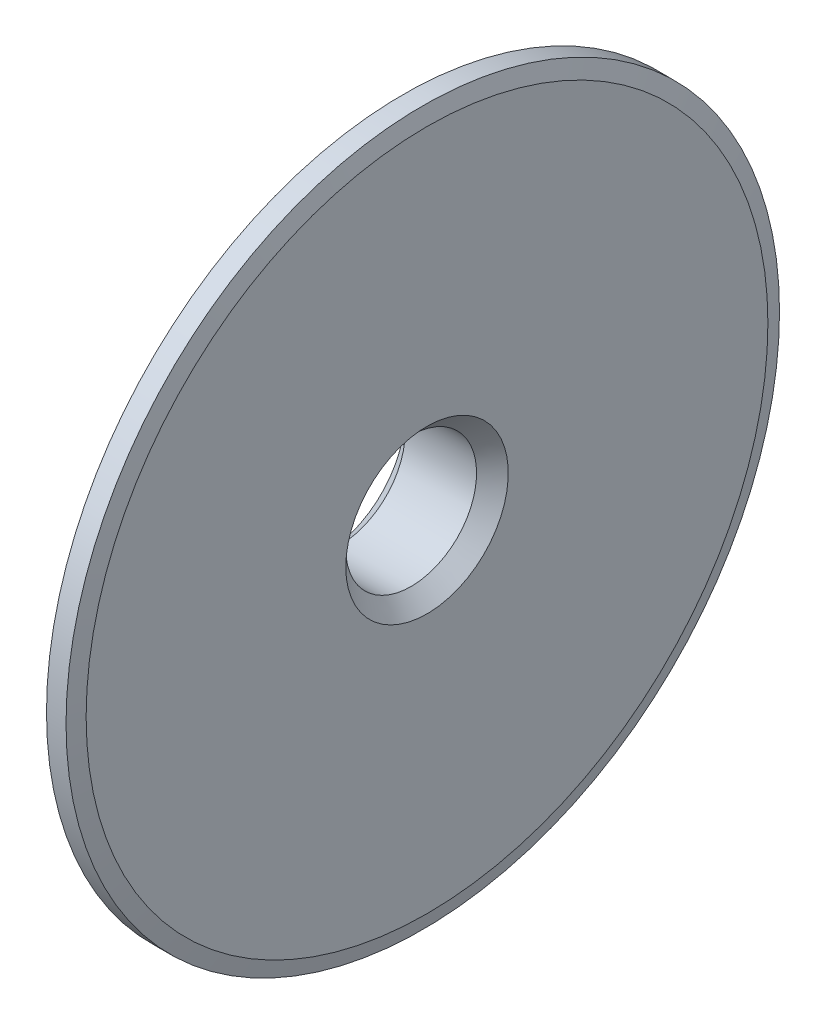
ISO-10303-21;
HEADER;
FILE_DESCRIPTION(('STEP AP214'),'2;1');
FILE_NAME('part.step','',(''),(''),'','','');
FILE_SCHEMA(('AUTOMOTIVE_DESIGN { 1 0 10303 214 1 1 1 1 }'));
ENDSEC;
DATA;
#1=APPLICATION_CONTEXT('core data for automotive mechanical design processes');
#2=APPLICATION_PROTOCOL_DEFINITION('international standard','automotive_design',2000,#1);
#3=PRODUCT_CONTEXT('',#1,'mechanical');
#4=PRODUCT('Part','Part','',(#3));
#5=PRODUCT_RELATED_PRODUCT_CATEGORY('part','',(#4));
#6=PRODUCT_DEFINITION_FORMATION('','',#4);
#7=PRODUCT_DEFINITION_CONTEXT('part definition',#1,'design');
#8=PRODUCT_DEFINITION('design','',#6,#7);
#9=PRODUCT_DEFINITION_SHAPE('','',#8);
#10=(LENGTH_UNIT() NAMED_UNIT(*) SI_UNIT(.MILLI.,.METRE.));
#11=(NAMED_UNIT(*) PLANE_ANGLE_UNIT() SI_UNIT($,.RADIAN.));
#12=(NAMED_UNIT(*) SI_UNIT($,.STERADIAN.) SOLID_ANGLE_UNIT());
#13=UNCERTAINTY_MEASURE_WITH_UNIT(LENGTH_MEASURE(1.E-05),#10,'distance_accuracy_value','');
#14=(GEOMETRIC_REPRESENTATION_CONTEXT(3) GLOBAL_UNCERTAINTY_ASSIGNED_CONTEXT((#13)) GLOBAL_UNIT_ASSIGNED_CONTEXT((#10,
#11,#12)) REPRESENTATION_CONTEXT('',''));
#15=CARTESIAN_POINT('',(0.,0.,0.));
#16=DIRECTION('',(0.,0.,1.));
#17=DIRECTION('',(1.,0.,0.));
#18=AXIS2_PLACEMENT_3D('',#15,#16,#17);
#19=CARTESIAN_POINT('',(0.,12.5,0.));
#20=DIRECTION('',(1.,0.,0.));
#21=DIRECTION('',(0.,0.,-1.));
#22=AXIS2_PLACEMENT_3D('',#19,#20,#21);
#23=PLANE('',#22);
#24=CARTESIAN_POINT('',(0.,0.,0.));
#25=DIRECTION('',(1.,0.,0.));
#26=DIRECTION('',(0.,0.,-1.));
#27=AXIS2_PLACEMENT_3D('',#24,#25,#26);
#28=CIRCLE('',#27,12.);
#29=CARTESIAN_POINT('',(0.,0.,-12.));
#30=VERTEX_POINT('',#29);
#31=EDGE_CURVE('E80',#30,#30,#28,.F.);
#32=ORIENTED_EDGE('',*,*,#31,.T.);
#33=EDGE_LOOP('',(#32));
#34=FACE_BOUND('',#33,.T.);
#35=CARTESIAN_POINT('',(0.,0.,0.));
#36=DIRECTION('',(1.,0.,0.));
#37=DIRECTION('',(0.,0.,-1.));
#38=AXIS2_PLACEMENT_3D('',#35,#36,#37);
#39=CIRCLE('',#38,10.25);
#40=CARTESIAN_POINT('',(0.,0.,-10.25));
#41=VERTEX_POINT('',#40);
#42=EDGE_CURVE('E84',#41,#41,#39,.T.);
#43=ORIENTED_EDGE('',*,*,#42,.T.);
#44=EDGE_LOOP('',(#43));
#45=FACE_BOUND('',#44,.T.);
#46=ADVANCED_FACE('F51',(#34,#45),#23,.F.);
#47=CARTESIAN_POINT('',(0.,0.,0.));
#48=DIRECTION('',(-1.,0.,0.));
#49=DIRECTION('',(0.,0.,1.));
#50=AXIS2_PLACEMENT_3D('',#47,#48,#49);
#51=CYLINDRICAL_SURFACE('',#50,8.25);
#52=CARTESIAN_POINT('',(11.,0.,0.));
#53=DIRECTION('',(-1.,0.,0.));
#54=DIRECTION('',(0.,0.,1.));
#55=AXIS2_PLACEMENT_3D('',#52,#53,#54);
#56=CIRCLE('',#55,8.25);
#57=CARTESIAN_POINT('',(11.,0.,8.25));
#58=VERTEX_POINT('',#57);
#59=EDGE_CURVE('E88',#58,#58,#56,.F.);
#60=ORIENTED_EDGE('',*,*,#59,.T.);
#61=EDGE_LOOP('',(#60));
#62=FACE_BOUND('',#61,.T.);
#63=CARTESIAN_POINT('',(1.99999999999999,0.,0.));
#64=DIRECTION('',(1.,0.,0.));
#65=DIRECTION('',(0.,0.,-1.));
#66=AXIS2_PLACEMENT_3D('',#63,#64,#65);
#67=CIRCLE('',#66,8.25);
#68=CARTESIAN_POINT('',(1.99999999999999,0.,-8.25));
#69=VERTEX_POINT('',#68);
#70=EDGE_CURVE('E92',#69,#69,#67,.F.);
#71=ORIENTED_EDGE('',*,*,#70,.T.);
#72=EDGE_LOOP('',(#71));
#73=FACE_BOUND('',#72,.T.);
#74=ADVANCED_FACE('F145',(#62,#73),#51,.F.);
#75=CARTESIAN_POINT('',(13.,8.25,0.));
#76=DIRECTION('',(-1.,0.,0.));
#77=DIRECTION('',(0.,0.,1.));
#78=AXIS2_PLACEMENT_3D('',#75,#76,#77);
#79=PLANE('',#78);
#80=CARTESIAN_POINT('',(13.,0.,0.));
#81=DIRECTION('',(-1.,0.,0.));
#82=DIRECTION('',(0.,0.,1.));
#83=AXIS2_PLACEMENT_3D('',#80,#81,#82);
#84=CIRCLE('',#83,10.25);
#85=CARTESIAN_POINT('',(13.,0.,10.25));
#86=VERTEX_POINT('',#85);
#87=EDGE_CURVE('E96',#86,#86,#84,.T.);
#88=ORIENTED_EDGE('',*,*,#87,.T.);
#89=EDGE_LOOP('',(#88));
#90=FACE_BOUND('',#89,.T.);
#91=CARTESIAN_POINT('',(13.,0.,0.));
#92=DIRECTION('',(-1.,0.,0.));
#93=DIRECTION('',(0.,0.,1.));
#94=AXIS2_PLACEMENT_3D('',#91,#92,#93);
#95=CIRCLE('',#94,43.);
#96=CARTESIAN_POINT('',(13.,0.,43.));
#97=VERTEX_POINT('',#96);
#98=EDGE_CURVE('E100',#97,#97,#95,.T.);
#99=ORIENTED_EDGE('',*,*,#98,.F.);
#100=EDGE_LOOP('',(#99));
#101=FACE_BOUND('',#100,.T.);
#102=ADVANCED_FACE('F153',(#90,#101),#79,.F.);
#103=CARTESIAN_POINT('',(13.,0.,0.));
#104=DIRECTION('',(-1.,0.,0.));
#105=DIRECTION('',(0.,0.,1.));
#106=AXIS2_PLACEMENT_3D('',#103,#104,#105);
#107=CONICAL_SURFACE('',#106,43.,1.30899693899575);
#108=CARTESIAN_POINT('',(12.4641016151378,0.,0.));
#109=DIRECTION('',(-1.,0.,0.));
#110=DIRECTION('',(0.,0.,1.));
#111=AXIS2_PLACEMENT_3D('',#108,#109,#110);
#112=CIRCLE('',#111,45.);
#113=CARTESIAN_POINT('',(12.4641016151378,0.,45.));
#114=VERTEX_POINT('',#113);
#115=EDGE_CURVE('E104',#114,#114,#112,.T.);
#116=ORIENTED_EDGE('',*,*,#115,.F.);
#117=EDGE_LOOP('',(#116));
#118=FACE_BOUND('',#117,.T.);
#119=ORIENTED_EDGE('',*,*,#98,.T.);
#120=EDGE_LOOP('',(#119));
#121=FACE_BOUND('',#120,.T.);
#122=ADVANCED_FACE('F271',(#118,#121),#107,.T.);
#123=CARTESIAN_POINT('',(0.,0.,0.));
#124=DIRECTION('',(-1.,0.,0.));
#125=DIRECTION('',(0.,0.,1.));
#126=AXIS2_PLACEMENT_3D('',#123,#124,#125);
#127=CYLINDRICAL_SURFACE('',#126,45.);
#128=CARTESIAN_POINT('',(9.99999999999999,0.,0.));
#129=DIRECTION('',(-1.,0.,0.));
#130=DIRECTION('',(0.,0.,1.));
#131=AXIS2_PLACEMENT_3D('',#128,#129,#130);
#132=CIRCLE('',#131,45.);
#133=CARTESIAN_POINT('',(9.99999999999999,0.,45.));
#134=VERTEX_POINT('',#133);
#135=EDGE_CURVE('E108',#134,#134,#132,.T.);
#136=ORIENTED_EDGE('',*,*,#135,.F.);
#137=EDGE_LOOP('',(#136));
#138=FACE_BOUND('',#137,.T.);
#139=ORIENTED_EDGE('',*,*,#115,.T.);
#140=EDGE_LOOP('',(#139));
#141=FACE_BOUND('',#140,.T.);
#142=ADVANCED_FACE('F261',(#138,#141),#127,.T.);
#143=CARTESIAN_POINT('',(9.99999999999999,45.,0.));
#144=DIRECTION('',(1.,0.,0.));
#145=DIRECTION('',(0.,0.,-1.));
#146=AXIS2_PLACEMENT_3D('',#143,#144,#145);
#147=PLANE('',#146);
#148=CARTESIAN_POINT('',(9.99999999999999,0.,0.));
#149=DIRECTION('',(-1.,0.,0.));
#150=DIRECTION('',(0.,0.,1.));
#151=AXIS2_PLACEMENT_3D('',#148,#149,#150);
#152=CIRCLE('',#151,32.5);
#153=CARTESIAN_POINT('',(9.99999999999999,0.,32.5));
#154=VERTEX_POINT('',#153);
#155=EDGE_CURVE('E112',#154,#154,#152,.T.);
#156=ORIENTED_EDGE('',*,*,#155,.F.);
#157=EDGE_LOOP('',(#156));
#158=FACE_BOUND('',#157,.T.);
#159=ORIENTED_EDGE('',*,*,#135,.T.);
#160=EDGE_LOOP('',(#159));
#161=FACE_BOUND('',#160,.T.);
#162=ADVANCED_FACE('F253',(#158,#161),#147,.F.);
#163=CARTESIAN_POINT('',(0.,0.,0.));
#164=DIRECTION('',(-1.,0.,0.));
#165=DIRECTION('',(0.,0.,1.));
#166=AXIS2_PLACEMENT_3D('',#163,#164,#165);
#167=CYLINDRICAL_SURFACE('',#166,32.5);
#168=CARTESIAN_POINT('',(4.5,0.,0.));
#169=DIRECTION('',(1.,0.,0.));
#170=DIRECTION('',(0.,0.,-1.));
#171=AXIS2_PLACEMENT_3D('',#168,#169,#170);
#172=CIRCLE('',#171,32.5);
#173=CARTESIAN_POINT('',(4.5,0.,-32.5));
#174=VERTEX_POINT('',#173);
#175=EDGE_CURVE('E10',#174,#174,#172,.T.);
#176=ORIENTED_EDGE('',*,*,#175,.T.);
#177=EDGE_LOOP('',(#176));
#178=FACE_BOUND('',#177,.T.);
#179=ORIENTED_EDGE('',*,*,#155,.T.);
#180=EDGE_LOOP('',(#179));
#181=FACE_BOUND('',#180,.T.);
#182=ADVANCED_FACE('F142',(#178,#181),#167,.T.);
#183=CARTESIAN_POINT('',(4.,32.5,0.));
#184=DIRECTION('',(1.,0.,0.));
#185=DIRECTION('',(0.,0.,-1.));
#186=AXIS2_PLACEMENT_3D('',#183,#184,#185);
#187=PLANE('',#186);
#188=CARTESIAN_POINT('',(4.,0.,0.));
#189=DIRECTION('',(1.,0.,0.));
#190=DIRECTION('',(0.,0.,-1.));
#191=AXIS2_PLACEMENT_3D('',#188,#189,#190);
#192=CIRCLE('',#191,31.);
#193=CARTESIAN_POINT('',(4.,0.,-31.));
#194=VERTEX_POINT('',#193);
#195=EDGE_CURVE('E60',#194,#194,#192,.T.);
#196=ORIENTED_EDGE('',*,*,#195,.T.);
#197=EDGE_LOOP('',(#196));
#198=FACE_BOUND('',#197,.T.);
#199=CARTESIAN_POINT('',(4.,0.,0.));
#200=DIRECTION('',(1.,0.,0.));
#201=DIRECTION('',(0.,0.,-1.));
#202=AXIS2_PLACEMENT_3D('',#199,#200,#201);
#203=CIRCLE('',#202,32.);
#204=CARTESIAN_POINT('',(4.,0.,-32.));
#205=VERTEX_POINT('',#204);
#206=EDGE_CURVE('E65',#205,#205,#203,.F.);
#207=ORIENTED_EDGE('',*,*,#206,.T.);
#208=EDGE_LOOP('',(#207));
#209=FACE_BOUND('',#208,.T.);
#210=ADVANCED_FACE('F135',(#198,#209),#187,.F.);
#211=CARTESIAN_POINT('',(0.,0.,0.));
#212=DIRECTION('',(-1.,0.,0.));
#213=DIRECTION('',(0.,0.,1.));
#214=AXIS2_PLACEMENT_3D('',#211,#212,#213);
#215=CYLINDRICAL_SURFACE('',#214,30.5);
#216=CARTESIAN_POINT('',(4.50000000000001,0.,0.));
#217=DIRECTION('',(1.,0.,0.));
#218=DIRECTION('',(0.,0.,-1.));
#219=AXIS2_PLACEMENT_3D('',#216,#217,#218);
#220=CIRCLE('',#219,30.5);
#221=CARTESIAN_POINT('',(4.50000000000001,0.,-30.5));
#222=VERTEX_POINT('',#221);
#223=EDGE_CURVE('E70',#222,#222,#220,.F.);
#224=ORIENTED_EDGE('',*,*,#223,.T.);
#225=EDGE_LOOP('',(#224));
#226=FACE_BOUND('',#225,.T.);
#227=CARTESIAN_POINT('',(10.,0.,0.));
#228=DIRECTION('',(-1.,0.,0.));
#229=DIRECTION('',(0.,0.,1.));
#230=AXIS2_PLACEMENT_3D('',#227,#228,#229);
#231=CIRCLE('',#230,30.5);
#232=CARTESIAN_POINT('',(10.,0.,30.5));
#233=VERTEX_POINT('',#232);
#234=EDGE_CURVE('E116',#233,#233,#231,.T.);
#235=ORIENTED_EDGE('',*,*,#234,.F.);
#236=EDGE_LOOP('',(#235));
#237=FACE_BOUND('',#236,.T.);
#238=ADVANCED_FACE('F130',(#226,#237),#215,.F.);
#239=CARTESIAN_POINT('',(10.,30.5,0.));
#240=DIRECTION('',(1.,0.,0.));
#241=DIRECTION('',(0.,0.,-1.));
#242=AXIS2_PLACEMENT_3D('',#239,#240,#241);
#243=PLANE('',#242);
#244=CARTESIAN_POINT('',(10.,0.,0.));
#245=DIRECTION('',(-1.,0.,0.));
#246=DIRECTION('',(0.,0.,1.));
#247=AXIS2_PLACEMENT_3D('',#244,#245,#246);
#248=CIRCLE('',#247,12.5);
#249=CARTESIAN_POINT('',(10.,0.,12.5));
#250=VERTEX_POINT('',#249);
#251=EDGE_CURVE('E120',#250,#250,#248,.T.);
#252=ORIENTED_EDGE('',*,*,#251,.F.);
#253=EDGE_LOOP('',(#252));
#254=FACE_BOUND('',#253,.T.);
#255=ORIENTED_EDGE('',*,*,#234,.T.);
#256=EDGE_LOOP('',(#255));
#257=FACE_BOUND('',#256,.T.);
#258=ADVANCED_FACE('F127',(#254,#257),#243,.F.);
#259=CARTESIAN_POINT('',(0.,0.,0.));
#260=DIRECTION('',(-1.,0.,0.));
#261=DIRECTION('',(0.,0.,1.));
#262=AXIS2_PLACEMENT_3D('',#259,#260,#261);
#263=CYLINDRICAL_SURFACE('',#262,12.5);
#264=CARTESIAN_POINT('',(0.500000000000035,0.,0.));
#265=DIRECTION('',(1.,0.,0.));
#266=DIRECTION('',(0.,0.,-1.));
#267=AXIS2_PLACEMENT_3D('',#264,#265,#266);
#268=CIRCLE('',#267,12.5);
#269=CARTESIAN_POINT('',(0.500000000000035,0.,-12.5));
#270=VERTEX_POINT('',#269);
#271=EDGE_CURVE('E76',#270,#270,#268,.T.);
#272=ORIENTED_EDGE('',*,*,#271,.T.);
#273=EDGE_LOOP('',(#272));
#274=FACE_BOUND('',#273,.T.);
#275=ORIENTED_EDGE('',*,*,#251,.T.);
#276=EDGE_LOOP('',(#275));
#277=FACE_BOUND('',#276,.T.);
#278=ADVANCED_FACE('F125',(#274,#277),#263,.T.);
#279=CARTESIAN_POINT('',(13.,0.,0.));
#280=DIRECTION('',(1.,0.,0.));
#281=DIRECTION('',(0.,0.,-1.));
#282=AXIS2_PLACEMENT_3D('',#279,#280,#281);
#283=CONICAL_SURFACE('',#282,10.25,0.785398163397445);
#284=ORIENTED_EDGE('',*,*,#59,.F.);
#285=EDGE_LOOP('',(#284));
#286=FACE_BOUND('',#285,.T.);
#287=ORIENTED_EDGE('',*,*,#87,.F.);
#288=EDGE_LOOP('',(#287));
#289=FACE_BOUND('',#288,.T.);
#290=ADVANCED_FACE('F160',(#286,#289),#283,.F.);
#291=CARTESIAN_POINT('',(1.99999999999999,0.,0.));
#292=DIRECTION('',(-1.,0.,0.));
#293=DIRECTION('',(0.,0.,1.));
#294=AXIS2_PLACEMENT_3D('',#291,#292,#293);
#295=CONICAL_SURFACE('',#294,8.25,0.785398163397448);
#296=ORIENTED_EDGE('',*,*,#42,.F.);
#297=EDGE_LOOP('',(#296));
#298=FACE_BOUND('',#297,.T.);
#299=ORIENTED_EDGE('',*,*,#70,.F.);
#300=EDGE_LOOP('',(#299));
#301=FACE_BOUND('',#300,.T.);
#302=ADVANCED_FACE('F166',(#298,#301),#295,.F.);
#303=CARTESIAN_POINT('',(0.,0.,0.));
#304=DIRECTION('',(1.,0.,0.));
#305=DIRECTION('',(0.,0.,-1.));
#306=AXIS2_PLACEMENT_3D('',#303,#304,#305);
#307=CONICAL_SURFACE('',#306,12.,0.785398163397431);
#308=ORIENTED_EDGE('',*,*,#271,.F.);
#309=EDGE_LOOP('',(#308));
#310=FACE_BOUND('',#309,.T.);
#311=ORIENTED_EDGE('',*,*,#31,.F.);
#312=EDGE_LOOP('',(#311));
#313=FACE_BOUND('',#312,.T.);
#314=ADVANCED_FACE('F172',(#310,#313),#307,.T.);
#315=CARTESIAN_POINT('',(4.50000000000001,0.,0.));
#316=DIRECTION('',(-1.,0.,0.));
#317=DIRECTION('',(0.,0.,1.));
#318=AXIS2_PLACEMENT_3D('',#315,#316,#317);
#319=CONICAL_SURFACE('',#318,30.5,0.785398163397438);
#320=ORIENTED_EDGE('',*,*,#195,.F.);
#321=EDGE_LOOP('',(#320));
#322=FACE_BOUND('',#321,.T.);
#323=ORIENTED_EDGE('',*,*,#223,.F.);
#324=EDGE_LOOP('',(#323));
#325=FACE_BOUND('',#324,.T.);
#326=ADVANCED_FACE('F178',(#322,#325),#319,.F.);
#327=CARTESIAN_POINT('',(4.,0.,0.));
#328=DIRECTION('',(1.,0.,0.));
#329=DIRECTION('',(0.,0.,-1.));
#330=AXIS2_PLACEMENT_3D('',#327,#328,#329);
#331=CONICAL_SURFACE('',#330,32.,0.785398163397435);
#332=ORIENTED_EDGE('',*,*,#175,.F.);
#333=EDGE_LOOP('',(#332));
#334=FACE_BOUND('',#333,.T.);
#335=ORIENTED_EDGE('',*,*,#206,.F.);
#336=EDGE_LOOP('',(#335));
#337=FACE_BOUND('',#336,.T.);
#338=ADVANCED_FACE('F54',(#334,#337),#331,.T.);
#339=CLOSED_SHELL('',(#46,#74,#102,#122,#142,#162,#182,#210,#238,#258,#278,#290,#302,#314,#326,#338));
#340=MANIFOLD_SOLID_BREP('B2',#339);
#341=ADVANCED_BREP_SHAPE_REPRESENTATION('',(#18,#340),#14);
#342=SHAPE_DEFINITION_REPRESENTATION(#9,#341);
ENDSEC;
END-ISO-10303-21;
